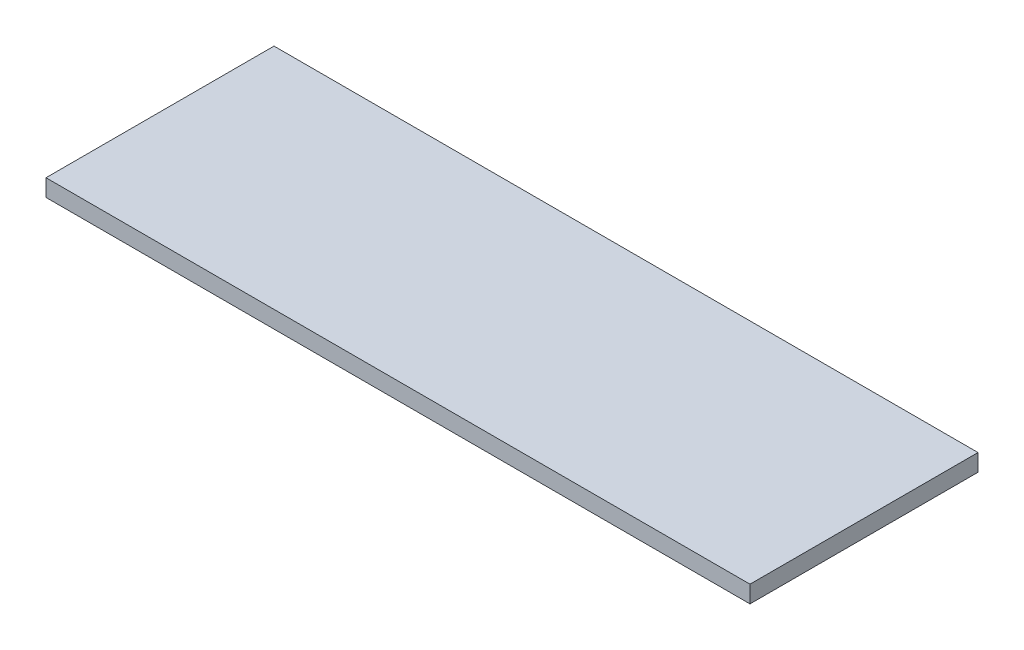
ISO-10303-21;
HEADER;
FILE_DESCRIPTION(('STEP AP214'),'2;1');
FILE_NAME('part.step','',(''),(''),'','','');
FILE_SCHEMA(('AUTOMOTIVE_DESIGN { 1 0 10303 214 1 1 1 1 }'));
ENDSEC;
DATA;
#1=APPLICATION_CONTEXT('core data for automotive mechanical design processes');
#2=APPLICATION_PROTOCOL_DEFINITION('international standard','automotive_design',2000,#1);
#3=PRODUCT_CONTEXT('',#1,'mechanical');
#4=PRODUCT('Part','Part','',(#3));
#5=PRODUCT_RELATED_PRODUCT_CATEGORY('part','',(#4));
#6=PRODUCT_DEFINITION_FORMATION('','',#4);
#7=PRODUCT_DEFINITION_CONTEXT('part definition',#1,'design');
#8=PRODUCT_DEFINITION('design','',#6,#7);
#9=PRODUCT_DEFINITION_SHAPE('','',#8);
#10=(LENGTH_UNIT() NAMED_UNIT(*) SI_UNIT(.MILLI.,.METRE.));
#11=(NAMED_UNIT(*) PLANE_ANGLE_UNIT() SI_UNIT($,.RADIAN.));
#12=(NAMED_UNIT(*) SI_UNIT($,.STERADIAN.) SOLID_ANGLE_UNIT());
#13=UNCERTAINTY_MEASURE_WITH_UNIT(LENGTH_MEASURE(1.E-05),#10,'distance_accuracy_value','');
#14=(GEOMETRIC_REPRESENTATION_CONTEXT(3) GLOBAL_UNCERTAINTY_ASSIGNED_CONTEXT((#13)) GLOBAL_UNIT_ASSIGNED_CONTEXT((#10,
#11,#12)) REPRESENTATION_CONTEXT('',''));
#15=CARTESIAN_POINT('',(0.,0.,0.));
#16=DIRECTION('',(0.,0.,1.));
#17=DIRECTION('',(1.,0.,0.));
#18=AXIS2_PLACEMENT_3D('',#15,#16,#17);
#19=CARTESIAN_POINT('',(0.,6.,0.));
#20=DIRECTION('',(1.,0.,0.));
#21=DIRECTION('',(0.,0.,-1.));
#22=AXIS2_PLACEMENT_3D('',#19,#20,#21);
#23=PLANE('',#22);
#24=DIRECTION('',(0.,0.,1.));
#25=VECTOR('',#24,1.);
#26=CARTESIAN_POINT('',(0.,0.,0.));
#27=LINE('',#26,#25);
#28=CARTESIAN_POINT('',(0.,0.,-80.));
#29=VERTEX_POINT('',#28);
#30=CARTESIAN_POINT('',(0.,0.,0.));
#31=VERTEX_POINT('',#30);
#32=EDGE_CURVE('E96',#29,#31,#27,.T.);
#33=ORIENTED_EDGE('',*,*,#32,.T.);
#34=DIRECTION('',(0.,-1.,0.));
#35=VECTOR('',#34,1.);
#36=CARTESIAN_POINT('',(0.,6.,0.));
#37=LINE('',#36,#35);
#38=CARTESIAN_POINT('',(0.,6.,0.));
#39=VERTEX_POINT('',#38);
#40=EDGE_CURVE('E11',#39,#31,#37,.T.);
#41=ORIENTED_EDGE('',*,*,#40,.F.);
#42=DIRECTION('',(0.,0.,1.));
#43=VECTOR('',#42,1.);
#44=CARTESIAN_POINT('',(0.,6.,0.));
#45=LINE('',#44,#43);
#46=CARTESIAN_POINT('',(0.,6.,-80.));
#47=VERTEX_POINT('',#46);
#48=EDGE_CURVE('E84',#47,#39,#45,.T.);
#49=ORIENTED_EDGE('',*,*,#48,.F.);
#50=DIRECTION('',(0.,-1.,0.));
#51=VECTOR('',#50,1.);
#52=CARTESIAN_POINT('',(0.,6.,-80.));
#53=LINE('',#52,#51);
#54=EDGE_CURVE('E92',#47,#29,#53,.T.);
#55=ORIENTED_EDGE('',*,*,#54,.T.);
#56=EDGE_LOOP('',(#33,#41,#49,#55));
#57=FACE_BOUND('',#56,.T.);
#58=ADVANCED_FACE('F33',(#57),#23,.F.);
#59=CARTESIAN_POINT('',(0.,6.,0.));
#60=DIRECTION('',(0.,0.,-1.));
#61=DIRECTION('',(-1.,0.,0.));
#62=AXIS2_PLACEMENT_3D('',#59,#60,#61);
#63=PLANE('',#62);
#64=DIRECTION('',(1.,0.,0.));
#65=VECTOR('',#64,1.);
#66=CARTESIAN_POINT('',(0.,0.,0.));
#67=LINE('',#66,#65);
#68=CARTESIAN_POINT('',(247.,0.,0.));
#69=VERTEX_POINT('',#68);
#70=EDGE_CURVE('E88',#31,#69,#67,.T.);
#71=ORIENTED_EDGE('',*,*,#70,.T.);
#72=DIRECTION('',(0.,-1.,0.));
#73=VECTOR('',#72,1.);
#74=CARTESIAN_POINT('',(247.,6.,0.));
#75=LINE('',#74,#73);
#76=CARTESIAN_POINT('',(247.,6.,0.));
#77=VERTEX_POINT('',#76);
#78=EDGE_CURVE('E41',#77,#69,#75,.T.);
#79=ORIENTED_EDGE('',*,*,#78,.F.);
#80=DIRECTION('',(1.,0.,0.));
#81=VECTOR('',#80,1.);
#82=CARTESIAN_POINT('',(0.,6.,0.));
#83=LINE('',#82,#81);
#84=EDGE_CURVE('E79',#39,#77,#83,.T.);
#85=ORIENTED_EDGE('',*,*,#84,.F.);
#86=ORIENTED_EDGE('',*,*,#40,.T.);
#87=EDGE_LOOP('',(#71,#79,#85,#86));
#88=FACE_BOUND('',#87,.T.);
#89=ADVANCED_FACE('F87',(#88),#63,.F.);
#90=CARTESIAN_POINT('',(247.,6.,0.));
#91=DIRECTION('',(-1.,0.,0.));
#92=DIRECTION('',(0.,0.,1.));
#93=AXIS2_PLACEMENT_3D('',#90,#91,#92);
#94=PLANE('',#93);
#95=DIRECTION('',(0.,0.,-1.));
#96=VECTOR('',#95,1.);
#97=CARTESIAN_POINT('',(247.,0.,0.));
#98=LINE('',#97,#96);
#99=CARTESIAN_POINT('',(247.,0.,-80.));
#100=VERTEX_POINT('',#99);
#101=EDGE_CURVE('E66',#69,#100,#98,.T.);
#102=ORIENTED_EDGE('',*,*,#101,.T.);
#103=DIRECTION('',(0.,-1.,0.));
#104=VECTOR('',#103,1.);
#105=CARTESIAN_POINT('',(247.,6.,-80.));
#106=LINE('',#105,#104);
#107=CARTESIAN_POINT('',(247.,6.,-80.));
#108=VERTEX_POINT('',#107);
#109=EDGE_CURVE('E89',#108,#100,#106,.T.);
#110=ORIENTED_EDGE('',*,*,#109,.F.);
#111=DIRECTION('',(0.,0.,-1.));
#112=VECTOR('',#111,1.);
#113=CARTESIAN_POINT('',(247.,6.,0.));
#114=LINE('',#113,#112);
#115=EDGE_CURVE('E82',#77,#108,#114,.T.);
#116=ORIENTED_EDGE('',*,*,#115,.F.);
#117=ORIENTED_EDGE('',*,*,#78,.T.);
#118=EDGE_LOOP('',(#102,#110,#116,#117));
#119=FACE_BOUND('',#118,.T.);
#120=ADVANCED_FACE('F90',(#119),#94,.F.);
#121=CARTESIAN_POINT('',(0.,6.,-80.));
#122=DIRECTION('',(0.,0.,1.));
#123=DIRECTION('',(1.,0.,0.));
#124=AXIS2_PLACEMENT_3D('',#121,#122,#123);
#125=PLANE('',#124);
#126=DIRECTION('',(-1.,0.,0.));
#127=VECTOR('',#126,1.);
#128=CARTESIAN_POINT('',(0.,0.,-80.));
#129=LINE('',#128,#127);
#130=EDGE_CURVE('E72',#100,#29,#129,.T.);
#131=ORIENTED_EDGE('',*,*,#130,.T.);
#132=ORIENTED_EDGE('',*,*,#54,.F.);
#133=DIRECTION('',(-1.,0.,0.));
#134=VECTOR('',#133,1.);
#135=CARTESIAN_POINT('',(0.,6.,-80.));
#136=LINE('',#135,#134);
#137=EDGE_CURVE('E49',#108,#47,#136,.T.);
#138=ORIENTED_EDGE('',*,*,#137,.F.);
#139=ORIENTED_EDGE('',*,*,#109,.T.);
#140=EDGE_LOOP('',(#131,#132,#138,#139));
#141=FACE_BOUND('',#140,.T.);
#142=ADVANCED_FACE('F103',(#141),#125,.F.);
#143=CARTESIAN_POINT('',(0.,6.,0.));
#144=DIRECTION('',(0.,-1.,0.));
#145=DIRECTION('',(0.,0.,-1.));
#146=AXIS2_PLACEMENT_3D('',#143,#144,#145);
#147=PLANE('',#146);
#148=ORIENTED_EDGE('',*,*,#48,.T.);
#149=ORIENTED_EDGE('',*,*,#84,.T.);
#150=ORIENTED_EDGE('',*,*,#115,.T.);
#151=ORIENTED_EDGE('',*,*,#137,.T.);
#152=EDGE_LOOP('',(#148,#149,#150,#151));
#153=FACE_BOUND('',#152,.T.);
#154=ADVANCED_FACE('F80',(#153),#147,.F.);
#155=CARTESIAN_POINT('',(0.,0.,0.));
#156=DIRECTION('',(0.,-1.,0.));
#157=DIRECTION('',(0.,0.,-1.));
#158=AXIS2_PLACEMENT_3D('',#155,#156,#157);
#159=PLANE('',#158);
#160=ORIENTED_EDGE('',*,*,#32,.F.);
#161=ORIENTED_EDGE('',*,*,#130,.F.);
#162=ORIENTED_EDGE('',*,*,#101,.F.);
#163=ORIENTED_EDGE('',*,*,#70,.F.);
#164=EDGE_LOOP('',(#160,#161,#162,#163));
#165=FACE_BOUND('',#164,.T.);
#166=ADVANCED_FACE('F106',(#165),#159,.T.);
#167=CLOSED_SHELL('',(#58,#89,#120,#142,#154,#166));
#168=MANIFOLD_SOLID_BREP('B2',#167);
#169=ADVANCED_BREP_SHAPE_REPRESENTATION('',(#18,#168),#14);
#170=SHAPE_DEFINITION_REPRESENTATION(#9,#169);
ENDSEC;
END-ISO-10303-21;
